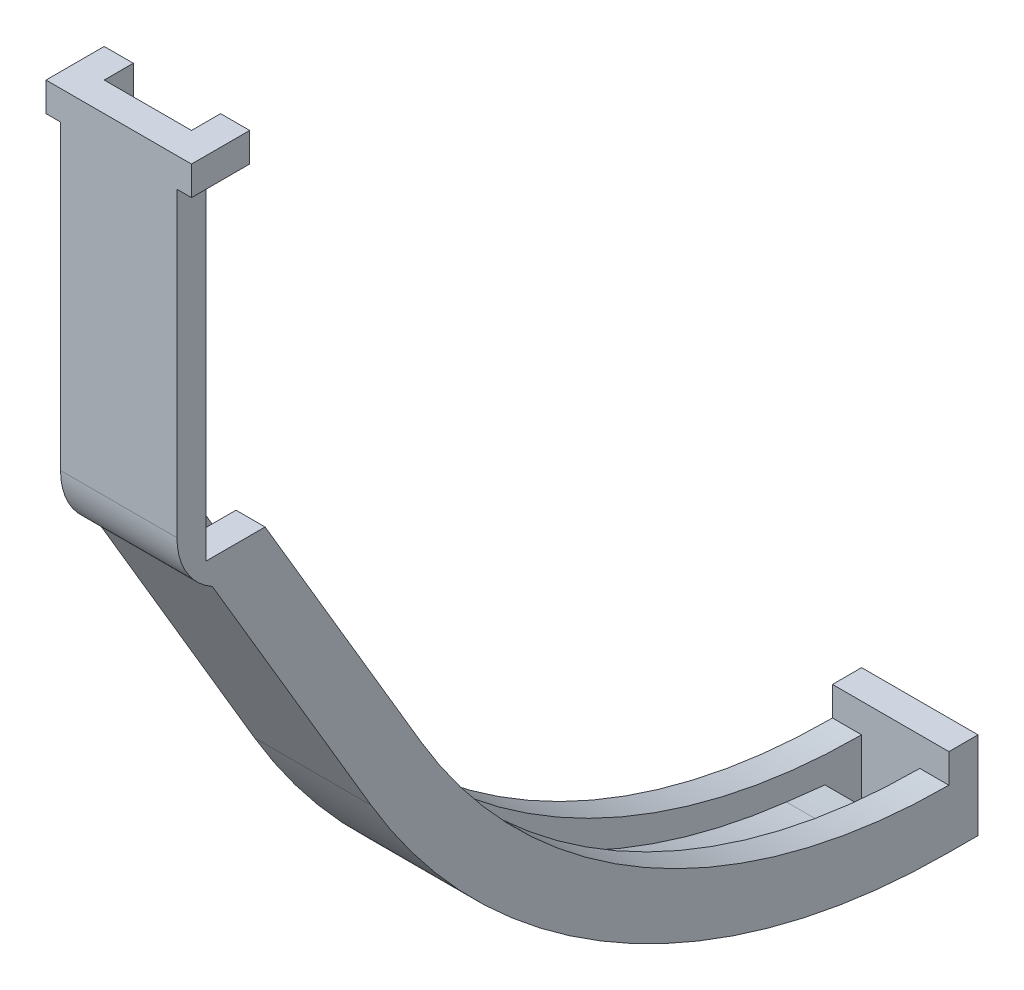
ISO-10303-21;
HEADER;
FILE_DESCRIPTION(('STEP AP214'),'2;1');
FILE_NAME('part.step','',(''),(''),'','','');
FILE_SCHEMA(('AUTOMOTIVE_DESIGN { 1 0 10303 214 1 1 1 1 }'));
ENDSEC;
DATA;
#1=APPLICATION_CONTEXT('core data for automotive mechanical design processes');
#2=APPLICATION_PROTOCOL_DEFINITION('international standard','automotive_design',2000,#1);
#3=PRODUCT_CONTEXT('',#1,'mechanical');
#4=PRODUCT('Part','Part','',(#3));
#5=PRODUCT_RELATED_PRODUCT_CATEGORY('part','',(#4));
#6=PRODUCT_DEFINITION_FORMATION('','',#4);
#7=PRODUCT_DEFINITION_CONTEXT('part definition',#1,'design');
#8=PRODUCT_DEFINITION('design','',#6,#7);
#9=PRODUCT_DEFINITION_SHAPE('','',#8);
#10=(LENGTH_UNIT() NAMED_UNIT(*) SI_UNIT(.MILLI.,.METRE.));
#11=(NAMED_UNIT(*) PLANE_ANGLE_UNIT() SI_UNIT($,.RADIAN.));
#12=(NAMED_UNIT(*) SI_UNIT($,.STERADIAN.) SOLID_ANGLE_UNIT());
#13=UNCERTAINTY_MEASURE_WITH_UNIT(LENGTH_MEASURE(1.E-05),#10,'distance_accuracy_value','');
#14=(GEOMETRIC_REPRESENTATION_CONTEXT(3) GLOBAL_UNCERTAINTY_ASSIGNED_CONTEXT((#13)) GLOBAL_UNIT_ASSIGNED_CONTEXT((#10,
#11,#12)) REPRESENTATION_CONTEXT('',''));
#15=CARTESIAN_POINT('',(0.,0.,0.));
#16=DIRECTION('',(0.,0.,1.));
#17=DIRECTION('',(1.,0.,0.));
#18=AXIS2_PLACEMENT_3D('',#15,#16,#17);
#19=CARTESIAN_POINT('',(-6.35,0.,0.));
#20=DIRECTION('',(1.,0.,0.));
#21=DIRECTION('',(0.,0.,-1.));
#22=AXIS2_PLACEMENT_3D('',#19,#20,#21);
#23=PLANE('',#22);
#24=DIRECTION('',(0.,0.,1.));
#25=VECTOR('',#24,1.);
#26=CARTESIAN_POINT('',(-6.35,-3.17499999999999,0.));
#27=LINE('',#26,#25);
#28=CARTESIAN_POINT('',(-6.34999999999999,-3.17499999999999,6.44000802));
#29=VERTEX_POINT('',#28);
#30=CARTESIAN_POINT('',(-6.34999999999999,-3.17499999999999,9.61500801999999));
#31=VERTEX_POINT('',#30);
#32=EDGE_CURVE('E487',#29,#31,#27,.T.);
#33=ORIENTED_EDGE('',*,*,#32,.F.);
#34=DIRECTION('',(0.,-1.,0.));
#35=VECTOR('',#34,1.);
#36=CARTESIAN_POINT('',(-6.35,-39.8949197300881,6.44000802));
#37=LINE('',#36,#35);
#38=CARTESIAN_POINT('',(-6.35,-39.8949197300881,6.44000802));
#39=VERTEX_POINT('',#38);
#40=EDGE_CURVE('E483',#29,#39,#37,.T.);
#41=ORIENTED_EDGE('',*,*,#40,.T.);
#42=DIRECTION('',(0.,0.,-1.));
#43=VECTOR('',#42,1.);
#44=CARTESIAN_POINT('',(-6.35,-39.8949197300881,-6.4400080213912));
#45=LINE('',#44,#43);
#46=CARTESIAN_POINT('',(-6.35,-39.8949197300881,0.));
#47=VERTEX_POINT('',#46);
#48=EDGE_CURVE('E332',#39,#47,#45,.T.);
#49=ORIENTED_EDGE('',*,*,#48,.T.);
#50=DIRECTION('',(0.,0.861061475587392,0.508500870460675));
#51=VECTOR('',#50,1.);
#52=CARTESIAN_POINT('',(-6.35,-10.3157544755255,17.4680109444969));
#53=LINE('',#52,#51);
#54=CARTESIAN_POINT('',(-6.35,-68.7332903355207,-17.0305337903155));
#55=VERTEX_POINT('',#54);
#56=EDGE_CURVE('E362',#55,#47,#53,.T.);
#57=ORIENTED_EDGE('',*,*,#56,.F.);
#58=CARTESIAN_POINT('',(-6.35,-34.7296686216215,-74.61));
#59=DIRECTION('',(1.,0.,0.));
#60=DIRECTION('',(0.,0.,-1.));
#61=AXIS2_PLACEMENT_3D('',#58,#59,#60);
#62=CIRCLE('',#61,66.8703313783785);
#63=CARTESIAN_POINT('',(-6.35,-101.6,-74.61));
#64=VERTEX_POINT('',#63);
#65=EDGE_CURVE('E383',#55,#64,#62,.T.);
#66=ORIENTED_EDGE('',*,*,#65,.T.);
#67=DIRECTION('',(0.,1.,0.));
#68=VECTOR('',#67,1.);
#69=CARTESIAN_POINT('',(-6.35,-101.6,-74.61));
#70=LINE('',#69,#68);
#71=CARTESIAN_POINT('',(-6.35,-98.425,-74.61));
#72=VERTEX_POINT('',#71);
#73=EDGE_CURVE('E386',#64,#72,#70,.T.);
#74=ORIENTED_EDGE('',*,*,#73,.T.);
#75=DIRECTION('',(0.,0.,-1.));
#76=VECTOR('',#75,1.);
#77=CARTESIAN_POINT('',(-6.35,-98.425,-74.61));
#78=LINE('',#77,#76);
#79=CARTESIAN_POINT('',(-6.35,-98.425,-77.785));
#80=VERTEX_POINT('',#79);
#81=EDGE_CURVE('E390',#72,#80,#78,.T.);
#82=ORIENTED_EDGE('',*,*,#81,.T.);
#83=DIRECTION('',(0.,-1.,0.));
#84=VECTOR('',#83,1.);
#85=CARTESIAN_POINT('',(-6.35,-98.425,-77.785));
#86=LINE('',#85,#84);
#87=CARTESIAN_POINT('',(-6.35,-107.95,-77.785));
#88=VERTEX_POINT('',#87);
#89=EDGE_CURVE('E393',#80,#88,#86,.T.);
#90=ORIENTED_EDGE('',*,*,#89,.T.);
#91=DIRECTION('',(0.,0.,-1.));
#92=VECTOR('',#91,1.);
#93=CARTESIAN_POINT('',(-6.35,-107.95,-74.61));
#94=LINE('',#93,#92);
#95=CARTESIAN_POINT('',(-6.35,-107.95,-74.61));
#96=VERTEX_POINT('',#95);
#97=EDGE_CURVE('E396',#96,#88,#94,.T.);
#98=ORIENTED_EDGE('',*,*,#97,.F.);
#99=CARTESIAN_POINT('',(-6.35,-34.7296686216215,-74.61));
#100=DIRECTION('',(1.,0.,0.));
#101=DIRECTION('',(0.,0.,-1.));
#102=AXIS2_PLACEMENT_3D('',#99,#100,#101);
#103=CIRCLE('',#102,73.2203313783785);
#104=CARTESIAN_POINT('',(-6.35,-71.962270862946,-11.5627934203356));
#105=VERTEX_POINT('',#104);
#106=EDGE_CURVE('E371',#105,#96,#103,.T.);
#107=ORIENTED_EDGE('',*,*,#106,.F.);
#108=DIRECTION('',(0.,0.861061475587392,0.508500870460675));
#109=VECTOR('',#108,1.);
#110=CARTESIAN_POINT('',(-6.35,-13.5447350029508,22.9357513144768));
#111=LINE('',#110,#109);
#112=CARTESIAN_POINT('',(-6.35,-42.6344563738377,5.75678203302842));
#113=VERTEX_POINT('',#112);
#114=EDGE_CURVE('E313',#105,#113,#111,.T.);
#115=ORIENTED_EDGE('',*,*,#114,.T.);
#116=CARTESIAN_POINT('',(-6.35,-36.1011936903704,2.15439927751977));
#117=DIRECTION('',(-1.,0.,0.));
#118=DIRECTION('',(0.,0.,-1.));
#119=AXIS2_PLACEMENT_3D('',#116,#117,#118);
#120=CIRCLE('',#119,7.46060874248023);
#121=CARTESIAN_POINT('',(-6.35,-36.1011936903704,9.61500801999999));
#122=VERTEX_POINT('',#121);
#123=EDGE_CURVE('E480',#113,#122,#120,.T.);
#124=ORIENTED_EDGE('',*,*,#123,.T.);
#125=DIRECTION('',(0.,1.,0.));
#126=VECTOR('',#125,1.);
#127=CARTESIAN_POINT('',(-6.35,0.,9.61500802));
#128=LINE('',#127,#126);
#129=EDGE_CURVE('E467',#122,#31,#128,.T.);
#130=ORIENTED_EDGE('',*,*,#129,.T.);
#131=EDGE_LOOP('',(#33,#41,#49,#57,#66,#74,#82,#90,#98,#107,#115,#124,#130));
#132=FACE_BOUND('',#131,.T.);
#133=ADVANCED_FACE('F77',(#132),#23,.F.);
#134=CARTESIAN_POINT('',(49.1586764343306,-39.8949197300881,6.44000802));
#135=DIRECTION('',(0.,0.,-1.));
#136=DIRECTION('',(0.,1.,0.));
#137=AXIS2_PLACEMENT_3D('',#134,#135,#136);
#138=PLANE('',#137);
#139=DIRECTION('',(-1.,0.,0.));
#140=VECTOR('',#139,1.);
#141=CARTESIAN_POINT('',(49.1586764343305,-3.17499999999993,6.44000802));
#142=LINE('',#141,#140);
#143=CARTESIAN_POINT('',(6.35,-3.17499999999999,6.44000802));
#144=VERTEX_POINT('',#143);
#145=CARTESIAN_POINT('',(4.7625,-3.17499999999999,6.44000802));
#146=VERTEX_POINT('',#145);
#147=EDGE_CURVE('E513',#144,#146,#142,.T.);
#148=ORIENTED_EDGE('',*,*,#147,.F.);
#149=DIRECTION('',(0.,-1.,0.));
#150=VECTOR('',#149,1.);
#151=CARTESIAN_POINT('',(6.35,-39.8949197300881,6.44000802));
#152=LINE('',#151,#150);
#153=CARTESIAN_POINT('',(6.35,-39.8949197300881,6.44000802));
#154=VERTEX_POINT('',#153);
#155=EDGE_CURVE('E462',#144,#154,#152,.T.);
#156=ORIENTED_EDGE('',*,*,#155,.T.);
#157=DIRECTION('',(-1.,0.,0.));
#158=VECTOR('',#157,1.);
#159=CARTESIAN_POINT('',(40.64,-39.8949197300881,6.44000802));
#160=LINE('',#159,#158);
#161=EDGE_CURVE('E459',#154,#39,#160,.T.);
#162=ORIENTED_EDGE('',*,*,#161,.T.);
#163=ORIENTED_EDGE('',*,*,#40,.F.);
#164=DIRECTION('',(1.,0.,0.));
#165=VECTOR('',#164,1.);
#166=CARTESIAN_POINT('',(49.1586764343306,-3.17500000000007,6.44000802));
#167=LINE('',#166,#165);
#168=CARTESIAN_POINT('',(-4.7625,-3.17499999999999,6.44000802));
#169=VERTEX_POINT('',#168);
#170=EDGE_CURVE('E489',#29,#169,#167,.T.);
#171=ORIENTED_EDGE('',*,*,#170,.T.);
#172=DIRECTION('',(0.,1.,0.));
#173=VECTOR('',#172,1.);
#174=CARTESIAN_POINT('',(-4.76250000000005,-39.894919730088,6.44000802));
#175=LINE('',#174,#173);
#176=CARTESIAN_POINT('',(-4.7625,0.,6.44000802));
#177=VERTEX_POINT('',#176);
#178=EDGE_CURVE('E492',#169,#177,#175,.T.);
#179=ORIENTED_EDGE('',*,*,#178,.T.);
#180=DIRECTION('',(-1.,0.,0.));
#181=VECTOR('',#180,1.);
#182=CARTESIAN_POINT('',(49.1586764343306,0.,6.44000802));
#183=LINE('',#182,#181);
#184=CARTESIAN_POINT('',(4.7625,0.,6.44000802));
#185=VERTEX_POINT('',#184);
#186=EDGE_CURVE('E100',#185,#177,#183,.T.);
#187=ORIENTED_EDGE('',*,*,#186,.F.);
#188=DIRECTION('',(0.,-1.,0.));
#189=VECTOR('',#188,1.);
#190=CARTESIAN_POINT('',(4.76250000000005,-39.8949197300881,6.44000802));
#191=LINE('',#190,#189);
#192=EDGE_CURVE('E524',#185,#146,#191,.T.);
#193=ORIENTED_EDGE('',*,*,#192,.T.);
#194=EDGE_LOOP('',(#148,#156,#162,#163,#171,#179,#187,#193));
#195=FACE_BOUND('',#194,.T.);
#196=ADVANCED_FACE('F577',(#195),#138,.T.);
#197=CARTESIAN_POINT('',(6.35,-10.3157544755255,17.4680109444969));
#198=DIRECTION('',(0.,-0.508500870460675,0.861061475587391));
#199=DIRECTION('',(0.,-0.861061475587392,-0.508500870460675));
#200=AXIS2_PLACEMENT_3D('',#197,#198,#199);
#201=PLANE('',#200);
#202=DIRECTION('',(0.,0.861061475587392,0.508500870460675));
#203=VECTOR('',#202,1.);
#204=CARTESIAN_POINT('',(3.175,-68.7332903355207,-17.0305337903155));
#205=LINE('',#204,#203);
#206=CARTESIAN_POINT('',(3.175,-68.7332903355207,-17.0305337903155));
#207=VERTEX_POINT('',#206);
#208=CARTESIAN_POINT('',(3.175,-39.8949197300881,0.));
#209=VERTEX_POINT('',#208);
#210=EDGE_CURVE('E346',#207,#209,#205,.T.);
#211=ORIENTED_EDGE('',*,*,#210,.T.);
#212=DIRECTION('',(1.,0.,0.));
#213=VECTOR('',#212,1.);
#214=CARTESIAN_POINT('',(-7.62,-39.8949197300881,0.));
#215=LINE('',#214,#213);
#216=CARTESIAN_POINT('',(6.35,-39.8949197300881,0.));
#217=VERTEX_POINT('',#216);
#218=EDGE_CURVE('E85',#209,#217,#215,.T.);
#219=ORIENTED_EDGE('',*,*,#218,.T.);
#220=DIRECTION('',(0.,0.861061475587392,0.508500870460675));
#221=VECTOR('',#220,1.);
#222=CARTESIAN_POINT('',(6.35,-10.3157544755255,17.4680109444969));
#223=LINE('',#222,#221);
#224=CARTESIAN_POINT('',(6.35,-68.7332903355207,-17.0305337903155));
#225=VERTEX_POINT('',#224);
#226=EDGE_CURVE('E333',#225,#217,#223,.T.);
#227=ORIENTED_EDGE('',*,*,#226,.F.);
#228=DIRECTION('',(-1.,0.,0.));
#229=VECTOR('',#228,1.);
#230=CARTESIAN_POINT('',(6.35,-68.7332903355207,-17.0305337903155));
#231=LINE('',#230,#229);
#232=EDGE_CURVE('E326',#225,#207,#231,.T.);
#233=ORIENTED_EDGE('',*,*,#232,.T.);
#234=EDGE_LOOP('',(#211,#219,#227,#233));
#235=FACE_BOUND('',#234,.T.);
#236=ADVANCED_FACE('F344',(#235),#201,.F.);
#237=CARTESIAN_POINT('',(6.35,-34.7296686216215,-74.61));
#238=DIRECTION('',(-1.,0.,0.));
#239=DIRECTION('',(0.,0.,1.));
#240=AXIS2_PLACEMENT_3D('',#237,#238,#239);
#241=CYLINDRICAL_SURFACE('',#240,66.8703313783785);
#242=DIRECTION('',(-1.,0.,0.));
#243=VECTOR('',#242,1.);
#244=CARTESIAN_POINT('',(6.35,-101.6,-74.61));
#245=LINE('',#244,#243);
#246=CARTESIAN_POINT('',(6.35,-101.6,-74.61));
#247=VERTEX_POINT('',#246);
#248=CARTESIAN_POINT('',(3.175,-101.6,-74.61));
#249=VERTEX_POINT('',#248);
#250=EDGE_CURVE('E323',#247,#249,#245,.T.);
#251=ORIENTED_EDGE('',*,*,#250,.T.);
#252=CARTESIAN_POINT('',(3.175,-34.7296686216215,-74.61));
#253=DIRECTION('',(-1.,0.,0.));
#254=DIRECTION('',(0.,0.,1.));
#255=AXIS2_PLACEMENT_3D('',#252,#253,#254);
#256=CIRCLE('',#255,66.8703313783785);
#257=EDGE_CURVE('E282',#249,#207,#256,.T.);
#258=ORIENTED_EDGE('',*,*,#257,.T.);
#259=ORIENTED_EDGE('',*,*,#232,.F.);
#260=CARTESIAN_POINT('',(6.35,-34.7296686216215,-74.61));
#261=DIRECTION('',(1.,0.,0.));
#262=DIRECTION('',(0.,0.,-1.));
#263=AXIS2_PLACEMENT_3D('',#260,#261,#262);
#264=CIRCLE('',#263,66.8703313783785);
#265=EDGE_CURVE('E358',#225,#247,#264,.T.);
#266=ORIENTED_EDGE('',*,*,#265,.T.);
#267=EDGE_LOOP('',(#251,#258,#259,#266));
#268=FACE_BOUND('',#267,.T.);
#269=ADVANCED_FACE('F79',(#268),#241,.F.);
#270=DIRECTION('',(0.,0.861061475587392,0.508500870460675));
#271=VECTOR('',#270,1.);
#272=CARTESIAN_POINT('',(-3.175,-68.7332903355207,-17.0305337903155));
#273=LINE('',#272,#271);
#274=CARTESIAN_POINT('',(-3.175,-68.7332903355207,-17.0305337903155));
#275=VERTEX_POINT('',#274);
#276=CARTESIAN_POINT('',(-3.17499999999989,-39.8949197300881,0.));
#277=VERTEX_POINT('',#276);
#278=EDGE_CURVE('E419',#275,#277,#273,.T.);
#279=ORIENTED_EDGE('',*,*,#278,.F.);
#280=EDGE_CURVE('E329',#275,#55,#231,.T.);
#281=ORIENTED_EDGE('',*,*,#280,.T.);
#282=ORIENTED_EDGE('',*,*,#56,.T.);
#283=EDGE_CURVE('E335',#47,#277,#215,.T.);
#284=ORIENTED_EDGE('',*,*,#283,.T.);
#285=EDGE_LOOP('',(#279,#281,#282,#284));
#286=FACE_BOUND('',#285,.T.);
#287=ADVANCED_FACE('F569',(#286),#201,.F.);
#288=ORIENTED_EDGE('',*,*,#280,.F.);
#289=CARTESIAN_POINT('',(-3.175,-34.7296686216215,-74.61));
#290=DIRECTION('',(1.,0.,0.));
#291=DIRECTION('',(0.,0.,-1.));
#292=AXIS2_PLACEMENT_3D('',#289,#290,#291);
#293=CIRCLE('',#292,66.8703313783785);
#294=CARTESIAN_POINT('',(-3.175,-101.6,-74.61));
#295=VERTEX_POINT('',#294);
#296=EDGE_CURVE('E424',#275,#295,#293,.T.);
#297=ORIENTED_EDGE('',*,*,#296,.T.);
#298=EDGE_CURVE('E325',#295,#64,#245,.T.);
#299=ORIENTED_EDGE('',*,*,#298,.T.);
#300=ORIENTED_EDGE('',*,*,#65,.F.);
#301=EDGE_LOOP('',(#288,#297,#299,#300));
#302=FACE_BOUND('',#301,.T.);
#303=ADVANCED_FACE('F573',(#302),#241,.F.);
#304=CARTESIAN_POINT('',(6.35,-13.5447350029508,22.9357513144768));
#305=DIRECTION('',(0.,-0.508500870460675,0.861061475587391));
#306=DIRECTION('',(0.,-0.861061475587392,-0.508500870460675));
#307=AXIS2_PLACEMENT_3D('',#304,#305,#306);
#308=PLANE('',#307);
#309=DIRECTION('',(-1.,0.,0.));
#310=VECTOR('',#309,1.);
#311=CARTESIAN_POINT('',(49.1586764343306,-42.6344563738377,5.75678203302842));
#312=LINE('',#311,#310);
#313=CARTESIAN_POINT('',(6.35,-42.6344563738377,5.75678203302842));
#314=VERTEX_POINT('',#313);
#315=EDGE_CURVE('E463',#314,#113,#312,.T.);
#316=ORIENTED_EDGE('',*,*,#315,.T.);
#317=ORIENTED_EDGE('',*,*,#114,.F.);
#318=DIRECTION('',(-1.,0.,0.));
#319=VECTOR('',#318,1.);
#320=CARTESIAN_POINT('',(6.35,-71.962270862946,-11.5627934203356));
#321=LINE('',#320,#319);
#322=CARTESIAN_POINT('',(6.35,-71.962270862946,-11.5627934203356));
#323=VERTEX_POINT('',#322);
#324=EDGE_CURVE('E309',#323,#105,#321,.T.);
#325=ORIENTED_EDGE('',*,*,#324,.F.);
#326=DIRECTION('',(0.,0.861061475587392,0.508500870460675));
#327=VECTOR('',#326,1.);
#328=CARTESIAN_POINT('',(6.35,-13.5447350029508,22.9357513144768));
#329=LINE('',#328,#327);
#330=EDGE_CURVE('E359',#323,#314,#329,.T.);
#331=ORIENTED_EDGE('',*,*,#330,.T.);
#332=EDGE_LOOP('',(#316,#317,#325,#331));
#333=FACE_BOUND('',#332,.T.);
#334=ADVANCED_FACE('F587',(#333),#308,.T.);
#335=CARTESIAN_POINT('',(6.35,0.,0.));
#336=DIRECTION('',(1.,0.,0.));
#337=DIRECTION('',(0.,0.,-1.));
#338=AXIS2_PLACEMENT_3D('',#335,#336,#337);
#339=PLANE('',#338);
#340=DIRECTION('',(0.,0.,-1.));
#341=VECTOR('',#340,1.);
#342=CARTESIAN_POINT('',(6.35,-3.17499999999999,0.));
#343=LINE('',#342,#341);
#344=CARTESIAN_POINT('',(6.35,-3.17499999999999,9.61500801999999));
#345=VERTEX_POINT('',#344);
#346=EDGE_CURVE('E522',#345,#144,#343,.T.);
#347=ORIENTED_EDGE('',*,*,#346,.F.);
#348=DIRECTION('',(0.,1.,0.));
#349=VECTOR('',#348,1.);
#350=CARTESIAN_POINT('',(6.35,0.,9.61500802));
#351=LINE('',#350,#349);
#352=CARTESIAN_POINT('',(6.35,-36.1011936903704,9.61500802));
#353=VERTEX_POINT('',#352);
#354=EDGE_CURVE('E471',#353,#345,#351,.T.);
#355=ORIENTED_EDGE('',*,*,#354,.F.);
#356=CARTESIAN_POINT('',(6.35,-36.1011936903704,2.15439927751977));
#357=DIRECTION('',(1.,0.,0.));
#358=DIRECTION('',(0.,0.,-1.));
#359=AXIS2_PLACEMENT_3D('',#356,#357,#358);
#360=CIRCLE('',#359,7.46060874248023);
#361=EDGE_CURVE('E466',#314,#353,#360,.F.);
#362=ORIENTED_EDGE('',*,*,#361,.F.);
#363=ORIENTED_EDGE('',*,*,#330,.F.);
#364=CARTESIAN_POINT('',(6.35,-34.7296686216215,-74.61));
#365=DIRECTION('',(1.,0.,0.));
#366=DIRECTION('',(0.,0.,-1.));
#367=AXIS2_PLACEMENT_3D('',#364,#365,#366);
#368=CIRCLE('',#367,73.2203313783785);
#369=CARTESIAN_POINT('',(6.35,-107.95,-74.61));
#370=VERTEX_POINT('',#369);
#371=EDGE_CURVE('E381',#323,#370,#368,.T.);
#372=ORIENTED_EDGE('',*,*,#371,.T.);
#373=DIRECTION('',(0.,0.,-1.));
#374=VECTOR('',#373,1.);
#375=CARTESIAN_POINT('',(6.35,-107.95,-74.61));
#376=LINE('',#375,#374);
#377=CARTESIAN_POINT('',(6.35,-107.95,-77.785));
#378=VERTEX_POINT('',#377);
#379=EDGE_CURVE('E308',#370,#378,#376,.T.);
#380=ORIENTED_EDGE('',*,*,#379,.T.);
#381=DIRECTION('',(0.,-1.,0.));
#382=VECTOR('',#381,1.);
#383=CARTESIAN_POINT('',(6.35,-98.425,-77.785));
#384=LINE('',#383,#382);
#385=CARTESIAN_POINT('',(6.35,-98.425,-77.785));
#386=VERTEX_POINT('',#385);
#387=EDGE_CURVE('E377',#386,#378,#384,.T.);
#388=ORIENTED_EDGE('',*,*,#387,.F.);
#389=DIRECTION('',(0.,0.,-1.));
#390=VECTOR('',#389,1.);
#391=CARTESIAN_POINT('',(6.35,-98.425,-74.61));
#392=LINE('',#391,#390);
#393=CARTESIAN_POINT('',(6.35,-98.425,-74.61));
#394=VERTEX_POINT('',#393);
#395=EDGE_CURVE('E374',#394,#386,#392,.T.);
#396=ORIENTED_EDGE('',*,*,#395,.F.);
#397=DIRECTION('',(0.,1.,0.));
#398=VECTOR('',#397,1.);
#399=CARTESIAN_POINT('',(6.35,-101.6,-74.61));
#400=LINE('',#399,#398);
#401=EDGE_CURVE('E370',#247,#394,#400,.T.);
#402=ORIENTED_EDGE('',*,*,#401,.F.);
#403=ORIENTED_EDGE('',*,*,#265,.F.);
#404=ORIENTED_EDGE('',*,*,#226,.T.);
#405=DIRECTION('',(0.,0.,-1.));
#406=VECTOR('',#405,1.);
#407=CARTESIAN_POINT('',(6.35,-39.8949197300881,-6.4400080213912));
#408=LINE('',#407,#406);
#409=EDGE_CURVE('E330',#154,#217,#408,.T.);
#410=ORIENTED_EDGE('',*,*,#409,.F.);
#411=ORIENTED_EDGE('',*,*,#155,.F.);
#412=EDGE_LOOP('',(#347,#355,#362,#363,#372,#380,#388,#396,#402,#403,#404,#410,#411));
#413=FACE_BOUND('',#412,.T.);
#414=ADVANCED_FACE('F353',(#413),#339,.T.);
#415=CARTESIAN_POINT('',(6.35,-101.6,-74.61));
#416=DIRECTION('',(0.,0.,1.));
#417=DIRECTION('',(1.,0.,0.));
#418=AXIS2_PLACEMENT_3D('',#415,#416,#417);
#419=PLANE('',#418);
#420=ORIENTED_EDGE('',*,*,#298,.F.);
#421=DIRECTION('',(0.,1.,0.));
#422=VECTOR('',#421,1.);
#423=CARTESIAN_POINT('',(-3.175,-104.775,-74.61));
#424=LINE('',#423,#422);
#425=CARTESIAN_POINT('',(-3.175,-107.95,-74.61));
#426=VERTEX_POINT('',#425);
#427=EDGE_CURVE('E92',#426,#295,#424,.T.);
#428=ORIENTED_EDGE('',*,*,#427,.F.);
#429=DIRECTION('',(-1.,0.,0.));
#430=VECTOR('',#429,1.);
#431=CARTESIAN_POINT('',(3.175,-107.95,-74.6100000000001));
#432=LINE('',#431,#430);
#433=CARTESIAN_POINT('',(3.175,-107.95,-74.6100000000001));
#434=VERTEX_POINT('',#433);
#435=EDGE_CURVE('E287',#434,#426,#432,.T.);
#436=ORIENTED_EDGE('',*,*,#435,.F.);
#437=DIRECTION('',(0.,1.,0.));
#438=VECTOR('',#437,1.);
#439=CARTESIAN_POINT('',(3.175,-104.775,-74.61));
#440=LINE('',#439,#438);
#441=EDGE_CURVE('E275',#434,#249,#440,.T.);
#442=ORIENTED_EDGE('',*,*,#441,.T.);
#443=ORIENTED_EDGE('',*,*,#250,.F.);
#444=ORIENTED_EDGE('',*,*,#401,.T.);
#445=DIRECTION('',(-1.,0.,0.));
#446=VECTOR('',#445,1.);
#447=CARTESIAN_POINT('',(6.35,-98.425,-74.61));
#448=LINE('',#447,#446);
#449=EDGE_CURVE('E321',#394,#72,#448,.T.);
#450=ORIENTED_EDGE('',*,*,#449,.T.);
#451=ORIENTED_EDGE('',*,*,#73,.F.);
#452=EDGE_LOOP('',(#420,#428,#436,#442,#443,#444,#450,#451));
#453=FACE_BOUND('',#452,.T.);
#454=ADVANCED_FACE('F288',(#453),#419,.T.);
#455=CARTESIAN_POINT('',(6.35,-98.425,-74.61));
#456=DIRECTION('',(0.,1.,0.));
#457=DIRECTION('',(0.,0.,1.));
#458=AXIS2_PLACEMENT_3D('',#455,#456,#457);
#459=PLANE('',#458);
#460=ORIENTED_EDGE('',*,*,#81,.F.);
#461=ORIENTED_EDGE('',*,*,#449,.F.);
#462=ORIENTED_EDGE('',*,*,#395,.T.);
#463=DIRECTION('',(-1.,0.,0.));
#464=VECTOR('',#463,1.);
#465=CARTESIAN_POINT('',(6.35,-98.425,-77.785));
#466=LINE('',#465,#464);
#467=EDGE_CURVE('E319',#386,#80,#466,.T.);
#468=ORIENTED_EDGE('',*,*,#467,.T.);
#469=EDGE_LOOP('',(#460,#461,#462,#468));
#470=FACE_BOUND('',#469,.T.);
#471=ADVANCED_FACE('F411',(#470),#459,.T.);
#472=CARTESIAN_POINT('',(6.35,-98.425,-77.785));
#473=DIRECTION('',(0.,0.,-1.));
#474=DIRECTION('',(-1.,0.,0.));
#475=AXIS2_PLACEMENT_3D('',#472,#473,#474);
#476=PLANE('',#475);
#477=ORIENTED_EDGE('',*,*,#89,.F.);
#478=ORIENTED_EDGE('',*,*,#467,.F.);
#479=ORIENTED_EDGE('',*,*,#387,.T.);
#480=DIRECTION('',(-1.,0.,0.));
#481=VECTOR('',#480,1.);
#482=CARTESIAN_POINT('',(6.35,-107.95,-77.785));
#483=LINE('',#482,#481);
#484=EDGE_CURVE('E315',#378,#88,#483,.T.);
#485=ORIENTED_EDGE('',*,*,#484,.T.);
#486=EDGE_LOOP('',(#477,#478,#479,#485));
#487=FACE_BOUND('',#486,.T.);
#488=ADVANCED_FACE('F407',(#487),#476,.T.);
#489=CARTESIAN_POINT('',(6.35,-107.95,-74.61));
#490=DIRECTION('',(0.,1.,0.));
#491=DIRECTION('',(0.,0.,1.));
#492=AXIS2_PLACEMENT_3D('',#489,#490,#491);
#493=PLANE('',#492);
#494=ORIENTED_EDGE('',*,*,#97,.T.);
#495=ORIENTED_EDGE('',*,*,#484,.F.);
#496=ORIENTED_EDGE('',*,*,#379,.F.);
#497=DIRECTION('',(-1.,0.,0.));
#498=VECTOR('',#497,1.);
#499=CARTESIAN_POINT('',(6.35,-107.95,-74.61));
#500=LINE('',#499,#498);
#501=EDGE_CURVE('E298',#370,#434,#500,.T.);
#502=ORIENTED_EDGE('',*,*,#501,.T.);
#503=ORIENTED_EDGE('',*,*,#435,.T.);
#504=EDGE_CURVE('E310',#426,#96,#500,.T.);
#505=ORIENTED_EDGE('',*,*,#504,.T.);
#506=EDGE_LOOP('',(#494,#495,#496,#502,#503,#505));
#507=FACE_BOUND('',#506,.T.);
#508=ADVANCED_FACE('F306',(#507),#493,.F.);
#509=CARTESIAN_POINT('',(6.35,-34.7296686216215,-74.61));
#510=DIRECTION('',(-1.,0.,0.));
#511=DIRECTION('',(0.,0.,1.));
#512=AXIS2_PLACEMENT_3D('',#509,#510,#511);
#513=CYLINDRICAL_SURFACE('',#512,73.2203313783785);
#514=DIRECTION('',(-1.,0.,0.));
#515=VECTOR('',#514,1.);
#516=CARTESIAN_POINT('',(6.35,-107.840659089263,-70.61));
#517=LINE('',#516,#515);
#518=CARTESIAN_POINT('',(-3.175,-107.840659089263,-70.61));
#519=VERTEX_POINT('',#518);
#520=CARTESIAN_POINT('',(3.175,-107.840659089263,-70.61));
#521=VERTEX_POINT('',#520);
#522=EDGE_CURVE('E301',#519,#521,#517,.F.);
#523=ORIENTED_EDGE('',*,*,#522,.T.);
#524=CARTESIAN_POINT('',(3.175,-34.7296686216215,-74.61));
#525=DIRECTION('',(1.,0.,0.));
#526=DIRECTION('',(0.,0.,-1.));
#527=AXIS2_PLACEMENT_3D('',#524,#525,#526);
#528=CIRCLE('',#527,73.2203313783785);
#529=EDGE_CURVE('E280',#521,#434,#528,.T.);
#530=ORIENTED_EDGE('',*,*,#529,.T.);
#531=ORIENTED_EDGE('',*,*,#501,.F.);
#532=ORIENTED_EDGE('',*,*,#371,.F.);
#533=ORIENTED_EDGE('',*,*,#324,.T.);
#534=ORIENTED_EDGE('',*,*,#106,.T.);
#535=ORIENTED_EDGE('',*,*,#504,.F.);
#536=CARTESIAN_POINT('',(-3.175,-34.7296686216215,-74.61));
#537=DIRECTION('',(-1.,0.,0.));
#538=DIRECTION('',(0.,0.,1.));
#539=AXIS2_PLACEMENT_3D('',#536,#537,#538);
#540=CIRCLE('',#539,73.2203313783785);
#541=EDGE_CURVE('E303',#426,#519,#540,.T.);
#542=ORIENTED_EDGE('',*,*,#541,.T.);
#543=EDGE_LOOP('',(#523,#530,#531,#532,#533,#534,#535,#542));
#544=FACE_BOUND('',#543,.T.);
#545=ADVANCED_FACE('F296',(#544),#513,.T.);
#546=CARTESIAN_POINT('',(-3.175,628.104447988835,-153.204666657603));
#547=DIRECTION('',(1.,0.,0.));
#548=DIRECTION('',(0.,0.,-1.));
#549=AXIS2_PLACEMENT_3D('',#546,#547,#548);
#550=CYLINDRICAL_SURFACE('',#549,737.081682659011);
#551=CARTESIAN_POINT('',(3.175,628.104447988835,-153.204666657603));
#552=DIRECTION('',(1.,0.,0.));
#553=DIRECTION('',(0.,0.,-1.));
#554=AXIS2_PLACEMENT_3D('',#551,#552,#553);
#555=CIRCLE('',#554,737.081682659011);
#556=CARTESIAN_POINT('',(3.175,-103.84966257243,-66.4141893924842));
#557=VERTEX_POINT('',#556);
#558=CARTESIAN_POINT('',(3.175,-104.334988381954,-70.61));
#559=VERTEX_POINT('',#558);
#560=EDGE_CURVE('E284',#557,#559,#555,.T.);
#561=ORIENTED_EDGE('',*,*,#560,.T.);
#562=DIRECTION('',(1.,0.,0.));
#563=VECTOR('',#562,1.);
#564=CARTESIAN_POINT('',(-3.175,-104.334988381954,-70.61));
#565=LINE('',#564,#563);
#566=CARTESIAN_POINT('',(-3.175,-104.334988381954,-70.61));
#567=VERTEX_POINT('',#566);
#568=EDGE_CURVE('E555',#559,#567,#565,.F.);
#569=ORIENTED_EDGE('',*,*,#568,.T.);
#570=CARTESIAN_POINT('',(-3.175,628.104447988835,-153.204666657603));
#571=DIRECTION('',(1.,0.,0.));
#572=DIRECTION('',(0.,0.,-1.));
#573=AXIS2_PLACEMENT_3D('',#570,#571,#572);
#574=CIRCLE('',#573,737.081682659011);
#575=CARTESIAN_POINT('',(-3.175,-103.84966257243,-66.4141893924842));
#576=VERTEX_POINT('',#575);
#577=EDGE_CURVE('E427',#576,#567,#574,.T.);
#578=ORIENTED_EDGE('',*,*,#577,.F.);
#579=DIRECTION('',(1.,0.,0.));
#580=VECTOR('',#579,1.);
#581=CARTESIAN_POINT('',(-3.175,-103.84966257243,-66.4141893924842));
#582=LINE('',#581,#580);
#583=EDGE_CURVE('E387',#576,#557,#582,.T.);
#584=ORIENTED_EDGE('',*,*,#583,.T.);
#585=EDGE_LOOP('',(#561,#569,#578,#584));
#586=FACE_BOUND('',#585,.T.);
#587=ADVANCED_FACE('F438',(#586),#550,.F.);
#588=CARTESIAN_POINT('',(-3.175,-34.7296686216215,-74.61));
#589=DIRECTION('',(1.,0.,0.));
#590=DIRECTION('',(0.,0.,-1.));
#591=AXIS2_PLACEMENT_3D('',#588,#589,#590);
#592=CYLINDRICAL_SURFACE('',#591,69.6042015633686);
#593=DIRECTION('',(1.,0.,0.));
#594=VECTOR('',#593,1.);
#595=CARTESIAN_POINT('',(-3.175,-70.1234657043146,-14.6765034947637));
#596=LINE('',#595,#594);
#597=CARTESIAN_POINT('',(-3.175,-70.1234657043146,-14.6765034947637));
#598=VERTEX_POINT('',#597);
#599=CARTESIAN_POINT('',(3.175,-70.1234657043146,-14.6765034947637));
#600=VERTEX_POINT('',#599);
#601=EDGE_CURVE('E433',#598,#600,#596,.T.);
#602=ORIENTED_EDGE('',*,*,#601,.T.);
#603=CARTESIAN_POINT('',(3.175,-34.7296686216215,-74.61));
#604=DIRECTION('',(1.,0.,0.));
#605=DIRECTION('',(0.,0.,-1.));
#606=AXIS2_PLACEMENT_3D('',#603,#604,#605);
#607=CIRCLE('',#606,69.6042015633686);
#608=EDGE_CURVE('E444',#600,#557,#607,.T.);
#609=ORIENTED_EDGE('',*,*,#608,.T.);
#610=ORIENTED_EDGE('',*,*,#583,.F.);
#611=CARTESIAN_POINT('',(-3.175,-34.7296686216215,-74.61));
#612=DIRECTION('',(1.,0.,0.));
#613=DIRECTION('',(0.,0.,-1.));
#614=AXIS2_PLACEMENT_3D('',#611,#612,#613);
#615=CIRCLE('',#614,69.6042015633686);
#616=EDGE_CURVE('E430',#598,#576,#615,.T.);
#617=ORIENTED_EDGE('',*,*,#616,.F.);
#618=EDGE_LOOP('',(#602,#609,#610,#617));
#619=FACE_BOUND('',#618,.T.);
#620=ADVANCED_FACE('F445',(#619),#592,.F.);
#621=CARTESIAN_POINT('',(-3.175,-39.8949197300881,3.175));
#622=DIRECTION('',(0.,-0.508500870460675,0.861061475587391));
#623=DIRECTION('',(0.,-0.861061475587391,-0.508500870460675));
#624=AXIS2_PLACEMENT_3D('',#621,#622,#623);
#625=PLANE('',#624);
#626=DIRECTION('',(0.,0.861061475587391,0.508500870460675));
#627=VECTOR('',#626,1.);
#628=CARTESIAN_POINT('',(-3.175,-39.8949197300881,3.175));
#629=LINE('',#628,#627);
#630=CARTESIAN_POINT('',(-3.175,-39.8949197300881,3.17500000000001));
#631=VERTEX_POINT('',#630);
#632=EDGE_CURVE('E416',#598,#631,#629,.T.);
#633=ORIENTED_EDGE('',*,*,#632,.T.);
#634=DIRECTION('',(1.,0.,0.));
#635=VECTOR('',#634,1.);
#636=CARTESIAN_POINT('',(-3.175,-39.8949197300881,3.17500000000001));
#637=LINE('',#636,#635);
#638=CARTESIAN_POINT('',(3.175,-39.8949197300881,3.17500000000001));
#639=VERTEX_POINT('',#638);
#640=EDGE_CURVE('E456',#631,#639,#637,.T.);
#641=ORIENTED_EDGE('',*,*,#640,.T.);
#642=DIRECTION('',(0.,0.861061475587391,0.508500870460675));
#643=VECTOR('',#642,1.);
#644=CARTESIAN_POINT('',(3.175,-39.8949197300881,3.175));
#645=LINE('',#644,#643);
#646=EDGE_CURVE('E448',#600,#639,#645,.T.);
#647=ORIENTED_EDGE('',*,*,#646,.F.);
#648=ORIENTED_EDGE('',*,*,#601,.F.);
#649=EDGE_LOOP('',(#633,#641,#647,#648));
#650=FACE_BOUND('',#649,.T.);
#651=ADVANCED_FACE('F565',(#650),#625,.F.);
#652=CARTESIAN_POINT('',(-3.175,-34.7296686216215,-74.61));
#653=DIRECTION('',(1.,0.,0.));
#654=DIRECTION('',(0.,0.,-1.));
#655=AXIS2_PLACEMENT_3D('',#652,#653,#654);
#656=PLANE('',#655);
#657=ORIENTED_EDGE('',*,*,#577,.T.);
#658=DIRECTION('',(0.,1.,0.));
#659=VECTOR('',#658,1.);
#660=CARTESIAN_POINT('',(-3.175,-107.95,-70.61));
#661=LINE('',#660,#659);
#662=EDGE_CURVE('E291',#519,#567,#661,.T.);
#663=ORIENTED_EDGE('',*,*,#662,.F.);
#664=ORIENTED_EDGE('',*,*,#541,.F.);
#665=ORIENTED_EDGE('',*,*,#427,.T.);
#666=ORIENTED_EDGE('',*,*,#296,.F.);
#667=ORIENTED_EDGE('',*,*,#278,.T.);
#668=DIRECTION('',(0.,0.,-1.));
#669=VECTOR('',#668,1.);
#670=CARTESIAN_POINT('',(-3.175,-39.8949197300882,-74.61));
#671=LINE('',#670,#669);
#672=EDGE_CURVE('E454',#631,#277,#671,.T.);
#673=ORIENTED_EDGE('',*,*,#672,.F.);
#674=ORIENTED_EDGE('',*,*,#632,.F.);
#675=ORIENTED_EDGE('',*,*,#616,.T.);
#676=EDGE_LOOP('',(#657,#663,#664,#665,#666,#667,#673,#674,#675));
#677=FACE_BOUND('',#676,.T.);
#678=ADVANCED_FACE('F562',(#677),#656,.T.);
#679=CARTESIAN_POINT('',(3.175,-34.7296686216215,-74.61));
#680=DIRECTION('',(-1.,0.,0.));
#681=DIRECTION('',(0.,0.,-1.));
#682=AXIS2_PLACEMENT_3D('',#679,#680,#681);
#683=PLANE('',#682);
#684=ORIENTED_EDGE('',*,*,#210,.F.);
#685=ORIENTED_EDGE('',*,*,#257,.F.);
#686=ORIENTED_EDGE('',*,*,#441,.F.);
#687=ORIENTED_EDGE('',*,*,#529,.F.);
#688=DIRECTION('',(0.,1.,0.));
#689=VECTOR('',#688,1.);
#690=CARTESIAN_POINT('',(3.175,-107.95,-70.61));
#691=LINE('',#690,#689);
#692=EDGE_CURVE('E450',#521,#559,#691,.T.);
#693=ORIENTED_EDGE('',*,*,#692,.T.);
#694=ORIENTED_EDGE('',*,*,#560,.F.);
#695=ORIENTED_EDGE('',*,*,#608,.F.);
#696=ORIENTED_EDGE('',*,*,#646,.T.);
#697=DIRECTION('',(0.,0.,1.));
#698=VECTOR('',#697,1.);
#699=CARTESIAN_POINT('',(3.175,-39.8949197300882,-74.61));
#700=LINE('',#699,#698);
#701=EDGE_CURVE('E12',#209,#639,#700,.T.);
#702=ORIENTED_EDGE('',*,*,#701,.F.);
#703=EDGE_LOOP('',(#684,#685,#686,#687,#693,#694,#695,#696,#702));
#704=FACE_BOUND('',#703,.T.);
#705=ADVANCED_FACE('F277',(#704),#683,.T.);
#706=CARTESIAN_POINT('',(40.64,-39.8949197300881,-6.44000802139121));
#707=DIRECTION('',(0.,-1.,0.));
#708=DIRECTION('',(0.,0.,-1.));
#709=AXIS2_PLACEMENT_3D('',#706,#707,#708);
#710=PLANE('',#709);
#711=ORIENTED_EDGE('',*,*,#161,.F.);
#712=ORIENTED_EDGE('',*,*,#409,.T.);
#713=ORIENTED_EDGE('',*,*,#218,.F.);
#714=ORIENTED_EDGE('',*,*,#701,.T.);
#715=ORIENTED_EDGE('',*,*,#640,.F.);
#716=ORIENTED_EDGE('',*,*,#672,.T.);
#717=ORIENTED_EDGE('',*,*,#283,.F.);
#718=ORIENTED_EDGE('',*,*,#48,.F.);
#719=EDGE_LOOP('',(#711,#712,#713,#714,#715,#716,#717,#718));
#720=FACE_BOUND('',#719,.T.);
#721=ADVANCED_FACE('F566',(#720),#710,.F.);
#722=CARTESIAN_POINT('',(49.1586764343306,0.,6.44000802));
#723=DIRECTION('',(0.,1.,0.));
#724=DIRECTION('',(0.,0.,1.));
#725=AXIS2_PLACEMENT_3D('',#722,#723,#724);
#726=PLANE('',#725);
#727=DIRECTION('',(0.,0.,-1.));
#728=VECTOR('',#727,1.);
#729=CARTESIAN_POINT('',(4.7625,0.,9.61500801999999));
#730=LINE('',#729,#728);
#731=CARTESIAN_POINT('',(4.7625,0.,3.26500801999999));
#732=VERTEX_POINT('',#731);
#733=EDGE_CURVE('E535',#185,#732,#730,.T.);
#734=ORIENTED_EDGE('',*,*,#733,.F.);
#735=ORIENTED_EDGE('',*,*,#186,.T.);
#736=DIRECTION('',(0.,0.,-1.));
#737=VECTOR('',#736,1.);
#738=CARTESIAN_POINT('',(-4.7625,0.,9.61500801999999));
#739=LINE('',#738,#737);
#740=CARTESIAN_POINT('',(-4.7625,0.,3.26500801999999));
#741=VERTEX_POINT('',#740);
#742=EDGE_CURVE('E511',#177,#741,#739,.T.);
#743=ORIENTED_EDGE('',*,*,#742,.T.);
#744=DIRECTION('',(1.,0.,0.));
#745=VECTOR('',#744,1.);
#746=CARTESIAN_POINT('',(-7.9375,0.,3.26500801999999));
#747=LINE('',#746,#745);
#748=CARTESIAN_POINT('',(-7.9375,0.,3.26500801999999));
#749=VERTEX_POINT('',#748);
#750=EDGE_CURVE('E495',#749,#741,#747,.T.);
#751=ORIENTED_EDGE('',*,*,#750,.F.);
#752=DIRECTION('',(0.,0.,-1.));
#753=VECTOR('',#752,1.);
#754=CARTESIAN_POINT('',(-7.9375,0.,9.61500801999999));
#755=LINE('',#754,#753);
#756=CARTESIAN_POINT('',(-7.9375,0.,9.61500801999999));
#757=VERTEX_POINT('',#756);
#758=EDGE_CURVE('E517',#757,#749,#755,.T.);
#759=ORIENTED_EDGE('',*,*,#758,.F.);
#760=DIRECTION('',(-1.,0.,0.));
#761=VECTOR('',#760,1.);
#762=CARTESIAN_POINT('',(49.1586764343306,0.,9.61500802));
#763=LINE('',#762,#761);
#764=CARTESIAN_POINT('',(7.9375,0.,9.61500801999999));
#765=VERTEX_POINT('',#764);
#766=EDGE_CURVE('E472',#765,#757,#763,.T.);
#767=ORIENTED_EDGE('',*,*,#766,.F.);
#768=DIRECTION('',(0.,0.,-1.));
#769=VECTOR('',#768,1.);
#770=CARTESIAN_POINT('',(7.9375,0.,9.61500801999999));
#771=LINE('',#770,#769);
#772=CARTESIAN_POINT('',(7.9375,0.,3.26500801999999));
#773=VERTEX_POINT('',#772);
#774=EDGE_CURVE('E534',#765,#773,#771,.T.);
#775=ORIENTED_EDGE('',*,*,#774,.T.);
#776=DIRECTION('',(-1.,0.,0.));
#777=VECTOR('',#776,1.);
#778=CARTESIAN_POINT('',(7.9375,0.,3.26500801999999));
#779=LINE('',#778,#777);
#780=EDGE_CURVE('E531',#773,#732,#779,.T.);
#781=ORIENTED_EDGE('',*,*,#780,.T.);
#782=EDGE_LOOP('',(#734,#735,#743,#751,#759,#767,#775,#781));
#783=FACE_BOUND('',#782,.T.);
#784=ADVANCED_FACE('F607',(#783),#726,.T.);
#785=CARTESIAN_POINT('',(49.1586764343306,0.,9.61500802));
#786=DIRECTION('',(0.,0.,1.));
#787=DIRECTION('',(0.,-1.,0.));
#788=AXIS2_PLACEMENT_3D('',#785,#786,#787);
#789=PLANE('',#788);
#790=ORIENTED_EDGE('',*,*,#354,.T.);
#791=DIRECTION('',(-1.,0.,0.));
#792=VECTOR('',#791,1.);
#793=CARTESIAN_POINT('',(7.9375,-3.17499999999999,9.61500801999999));
#794=LINE('',#793,#792);
#795=CARTESIAN_POINT('',(7.9375,-3.17499999999999,9.61500801999999));
#796=VERTEX_POINT('',#795);
#797=EDGE_CURVE('E527',#796,#345,#794,.T.);
#798=ORIENTED_EDGE('',*,*,#797,.F.);
#799=DIRECTION('',(0.,1.,0.));
#800=VECTOR('',#799,1.);
#801=CARTESIAN_POINT('',(7.9375,-3.17499999999999,9.61500801999999));
#802=LINE('',#801,#800);
#803=EDGE_CURVE('E537',#796,#765,#802,.T.);
#804=ORIENTED_EDGE('',*,*,#803,.T.);
#805=ORIENTED_EDGE('',*,*,#766,.T.);
#806=DIRECTION('',(0.,1.,0.));
#807=VECTOR('',#806,1.);
#808=CARTESIAN_POINT('',(-7.9375,-3.17499999999999,9.61500801999999));
#809=LINE('',#808,#807);
#810=CARTESIAN_POINT('',(-7.9375,-3.17499999999999,9.61500801999999));
#811=VERTEX_POINT('',#810);
#812=EDGE_CURVE('E508',#811,#757,#809,.T.);
#813=ORIENTED_EDGE('',*,*,#812,.F.);
#814=DIRECTION('',(1.,0.,0.));
#815=VECTOR('',#814,1.);
#816=CARTESIAN_POINT('',(-7.9375,-3.17499999999999,9.61500801999999));
#817=LINE('',#816,#815);
#818=EDGE_CURVE('E501',#811,#31,#817,.T.);
#819=ORIENTED_EDGE('',*,*,#818,.T.);
#820=ORIENTED_EDGE('',*,*,#129,.F.);
#821=DIRECTION('',(-1.,0.,0.));
#822=VECTOR('',#821,1.);
#823=CARTESIAN_POINT('',(49.1586764343306,-36.1011936903704,9.61500801999999));
#824=LINE('',#823,#822);
#825=EDGE_CURVE('E468',#353,#122,#824,.T.);
#826=ORIENTED_EDGE('',*,*,#825,.F.);
#827=EDGE_LOOP('',(#790,#798,#804,#805,#813,#819,#820,#826));
#828=FACE_BOUND('',#827,.T.);
#829=ADVANCED_FACE('F581',(#828),#789,.T.);
#830=CARTESIAN_POINT('',(49.1586764343306,-36.1011936903704,2.15439927751977));
#831=DIRECTION('',(-1.,0.,0.));
#832=DIRECTION('',(0.,0.,1.));
#833=AXIS2_PLACEMENT_3D('',#830,#831,#832);
#834=CYLINDRICAL_SURFACE('',#833,7.46060874248023);
#835=ORIENTED_EDGE('',*,*,#315,.F.);
#836=ORIENTED_EDGE('',*,*,#361,.T.);
#837=ORIENTED_EDGE('',*,*,#825,.T.);
#838=ORIENTED_EDGE('',*,*,#123,.F.);
#839=EDGE_LOOP('',(#835,#836,#837,#838));
#840=FACE_BOUND('',#839,.T.);
#841=ADVANCED_FACE('F585',(#840),#834,.T.);
#842=CARTESIAN_POINT('',(-7.9375,-3.17499999999999,3.26500801999999));
#843=DIRECTION('',(0.,1.,0.));
#844=DIRECTION('',(-1.,0.,0.));
#845=AXIS2_PLACEMENT_3D('',#842,#843,#844);
#846=PLANE('',#845);
#847=ORIENTED_EDGE('',*,*,#170,.F.);
#848=ORIENTED_EDGE('',*,*,#32,.T.);
#849=ORIENTED_EDGE('',*,*,#818,.F.);
#850=DIRECTION('',(0.,0.,1.));
#851=VECTOR('',#850,1.);
#852=CARTESIAN_POINT('',(-7.9375,-3.17499999999999,3.26500801999999));
#853=LINE('',#852,#851);
#854=CARTESIAN_POINT('',(-7.9375,-3.17499999999999,3.26500801999999));
#855=VERTEX_POINT('',#854);
#856=EDGE_CURVE('E504',#855,#811,#853,.T.);
#857=ORIENTED_EDGE('',*,*,#856,.F.);
#858=DIRECTION('',(1.,0.,0.));
#859=VECTOR('',#858,1.);
#860=CARTESIAN_POINT('',(-7.9375,-3.17499999999999,3.26500801999999));
#861=LINE('',#860,#859);
#862=CARTESIAN_POINT('',(-4.7625,-3.17499999999999,3.26500801999999));
#863=VERTEX_POINT('',#862);
#864=EDGE_CURVE('E498',#855,#863,#861,.T.);
#865=ORIENTED_EDGE('',*,*,#864,.T.);
#866=DIRECTION('',(0.,0.,1.));
#867=VECTOR('',#866,1.);
#868=CARTESIAN_POINT('',(-4.7625,-3.17499999999999,3.26500801999999));
#869=LINE('',#868,#867);
#870=EDGE_CURVE('E505',#863,#169,#869,.T.);
#871=ORIENTED_EDGE('',*,*,#870,.T.);
#872=EDGE_LOOP('',(#847,#848,#849,#857,#865,#871));
#873=FACE_BOUND('',#872,.T.);
#874=ADVANCED_FACE('F590',(#873),#846,.F.);
#875=CARTESIAN_POINT('',(-7.9375,0.,3.26500801999999));
#876=DIRECTION('',(0.,0.,1.));
#877=DIRECTION('',(0.,-1.,0.));
#878=AXIS2_PLACEMENT_3D('',#875,#876,#877);
#879=PLANE('',#878);
#880=DIRECTION('',(0.,-1.,0.));
#881=VECTOR('',#880,1.);
#882=CARTESIAN_POINT('',(-4.7625,0.,3.26500801999999));
#883=LINE('',#882,#881);
#884=EDGE_CURVE('E509',#741,#863,#883,.T.);
#885=ORIENTED_EDGE('',*,*,#884,.T.);
#886=ORIENTED_EDGE('',*,*,#864,.F.);
#887=DIRECTION('',(0.,-1.,0.));
#888=VECTOR('',#887,1.);
#889=CARTESIAN_POINT('',(-7.9375,0.,3.26500801999999));
#890=LINE('',#889,#888);
#891=EDGE_CURVE('E515',#749,#855,#890,.T.);
#892=ORIENTED_EDGE('',*,*,#891,.F.);
#893=ORIENTED_EDGE('',*,*,#750,.T.);
#894=EDGE_LOOP('',(#885,#886,#892,#893));
#895=FACE_BOUND('',#894,.T.);
#896=ADVANCED_FACE('F671',(#895),#879,.F.);
#897=CARTESIAN_POINT('',(-7.9375,0.,0.));
#898=DIRECTION('',(-1.,0.,0.));
#899=DIRECTION('',(0.,-1.,0.));
#900=AXIS2_PLACEMENT_3D('',#897,#898,#899);
#901=PLANE('',#900);
#902=ORIENTED_EDGE('',*,*,#812,.T.);
#903=ORIENTED_EDGE('',*,*,#758,.T.);
#904=ORIENTED_EDGE('',*,*,#891,.T.);
#905=ORIENTED_EDGE('',*,*,#856,.T.);
#906=EDGE_LOOP('',(#902,#903,#904,#905));
#907=FACE_BOUND('',#906,.T.);
#908=ADVANCED_FACE('F595',(#907),#901,.T.);
#909=CARTESIAN_POINT('',(-4.7625,0.,0.));
#910=DIRECTION('',(-1.,0.,0.));
#911=DIRECTION('',(0.,-1.,0.));
#912=AXIS2_PLACEMENT_3D('',#909,#910,#911);
#913=PLANE('',#912);
#914=ORIENTED_EDGE('',*,*,#178,.F.);
#915=ORIENTED_EDGE('',*,*,#870,.F.);
#916=ORIENTED_EDGE('',*,*,#884,.F.);
#917=ORIENTED_EDGE('',*,*,#742,.F.);
#918=EDGE_LOOP('',(#914,#915,#916,#917));
#919=FACE_BOUND('',#918,.T.);
#920=ADVANCED_FACE('F603',(#919),#913,.F.);
#921=CARTESIAN_POINT('',(7.9375,-3.17499999999999,3.26500801999999));
#922=DIRECTION('',(0.,-1.,0.));
#923=DIRECTION('',(1.,0.,0.));
#924=AXIS2_PLACEMENT_3D('',#921,#922,#923);
#925=PLANE('',#924);
#926=ORIENTED_EDGE('',*,*,#346,.T.);
#927=ORIENTED_EDGE('',*,*,#147,.T.);
#928=DIRECTION('',(0.,0.,1.));
#929=VECTOR('',#928,1.);
#930=CARTESIAN_POINT('',(4.7625,-3.17499999999999,3.26500801999999));
#931=LINE('',#930,#929);
#932=CARTESIAN_POINT('',(4.7625,-3.17499999999999,3.26500801999999));
#933=VERTEX_POINT('',#932);
#934=EDGE_CURVE('E302',#933,#146,#931,.T.);
#935=ORIENTED_EDGE('',*,*,#934,.F.);
#936=DIRECTION('',(-1.,0.,0.));
#937=VECTOR('',#936,1.);
#938=CARTESIAN_POINT('',(7.9375,-3.17499999999999,3.26500801999999));
#939=LINE('',#938,#937);
#940=CARTESIAN_POINT('',(7.9375,-3.17499999999999,3.26500801999999));
#941=VERTEX_POINT('',#940);
#942=EDGE_CURVE('E529',#941,#933,#939,.T.);
#943=ORIENTED_EDGE('',*,*,#942,.F.);
#944=DIRECTION('',(0.,0.,1.));
#945=VECTOR('',#944,1.);
#946=CARTESIAN_POINT('',(7.9375,-3.17499999999999,3.26500801999999));
#947=LINE('',#946,#945);
#948=EDGE_CURVE('E548',#941,#796,#947,.T.);
#949=ORIENTED_EDGE('',*,*,#948,.T.);
#950=ORIENTED_EDGE('',*,*,#797,.T.);
#951=EDGE_LOOP('',(#926,#927,#935,#943,#949,#950));
#952=FACE_BOUND('',#951,.T.);
#953=ADVANCED_FACE('F614',(#952),#925,.T.);
#954=CARTESIAN_POINT('',(7.9375,0.,3.26500801999999));
#955=DIRECTION('',(0.,0.,-1.));
#956=DIRECTION('',(0.,1.,0.));
#957=AXIS2_PLACEMENT_3D('',#954,#955,#956);
#958=PLANE('',#957);
#959=DIRECTION('',(0.,-1.,0.));
#960=VECTOR('',#959,1.);
#961=CARTESIAN_POINT('',(4.7625,0.,3.26500801999999));
#962=LINE('',#961,#960);
#963=EDGE_CURVE('E538',#732,#933,#962,.T.);
#964=ORIENTED_EDGE('',*,*,#963,.F.);
#965=ORIENTED_EDGE('',*,*,#780,.F.);
#966=DIRECTION('',(0.,-1.,0.));
#967=VECTOR('',#966,1.);
#968=CARTESIAN_POINT('',(7.9375,0.,3.26500801999999));
#969=LINE('',#968,#967);
#970=EDGE_CURVE('E545',#773,#941,#969,.T.);
#971=ORIENTED_EDGE('',*,*,#970,.T.);
#972=ORIENTED_EDGE('',*,*,#942,.T.);
#973=EDGE_LOOP('',(#964,#965,#971,#972));
#974=FACE_BOUND('',#973,.T.);
#975=ADVANCED_FACE('F612',(#974),#958,.T.);
#976=CARTESIAN_POINT('',(7.9375,0.,0.));
#977=DIRECTION('',(1.,0.,0.));
#978=DIRECTION('',(0.,-1.,0.));
#979=AXIS2_PLACEMENT_3D('',#976,#977,#978);
#980=PLANE('',#979);
#981=ORIENTED_EDGE('',*,*,#803,.F.);
#982=ORIENTED_EDGE('',*,*,#948,.F.);
#983=ORIENTED_EDGE('',*,*,#970,.F.);
#984=ORIENTED_EDGE('',*,*,#774,.F.);
#985=EDGE_LOOP('',(#981,#982,#983,#984));
#986=FACE_BOUND('',#985,.T.);
#987=ADVANCED_FACE('F621',(#986),#980,.T.);
#988=CARTESIAN_POINT('',(4.7625,0.,0.));
#989=DIRECTION('',(1.,0.,0.));
#990=DIRECTION('',(0.,-1.,0.));
#991=AXIS2_PLACEMENT_3D('',#988,#989,#990);
#992=PLANE('',#991);
#993=ORIENTED_EDGE('',*,*,#192,.F.);
#994=ORIENTED_EDGE('',*,*,#733,.T.);
#995=ORIENTED_EDGE('',*,*,#963,.T.);
#996=ORIENTED_EDGE('',*,*,#934,.T.);
#997=EDGE_LOOP('',(#993,#994,#995,#996));
#998=FACE_BOUND('',#997,.T.);
#999=ADVANCED_FACE('F605',(#998),#992,.F.);
#1000=CARTESIAN_POINT('',(3.175,-107.95,-70.61));
#1001=DIRECTION('',(0.,0.,1.));
#1002=DIRECTION('',(1.,0.,0.));
#1003=AXIS2_PLACEMENT_3D('',#1000,#1001,#1002);
#1004=PLANE('',#1003);
#1005=ORIENTED_EDGE('',*,*,#662,.T.);
#1006=ORIENTED_EDGE('',*,*,#568,.F.);
#1007=ORIENTED_EDGE('',*,*,#692,.F.);
#1008=ORIENTED_EDGE('',*,*,#522,.F.);
#1009=EDGE_LOOP('',(#1005,#1006,#1007,#1008));
#1010=FACE_BOUND('',#1009,.T.);
#1011=ADVANCED_FACE('F560',(#1010),#1004,.F.);
#1012=CLOSED_SHELL('',(#133,#196,#236,#269,#287,#303,#334,#414,#454,#471,#488,#508,#545,#587,
#620,#651,#678,#705,#721,#784,#829,#841,#874,#896,#908,#920,#953,#975,#987,#999,#1011));
#1013=MANIFOLD_SOLID_BREP('B2',#1012);
#1014=ADVANCED_BREP_SHAPE_REPRESENTATION('',(#18,#1013),#14);
#1015=SHAPE_DEFINITION_REPRESENTATION(#9,#1014);
ENDSEC;
END-ISO-10303-21;
